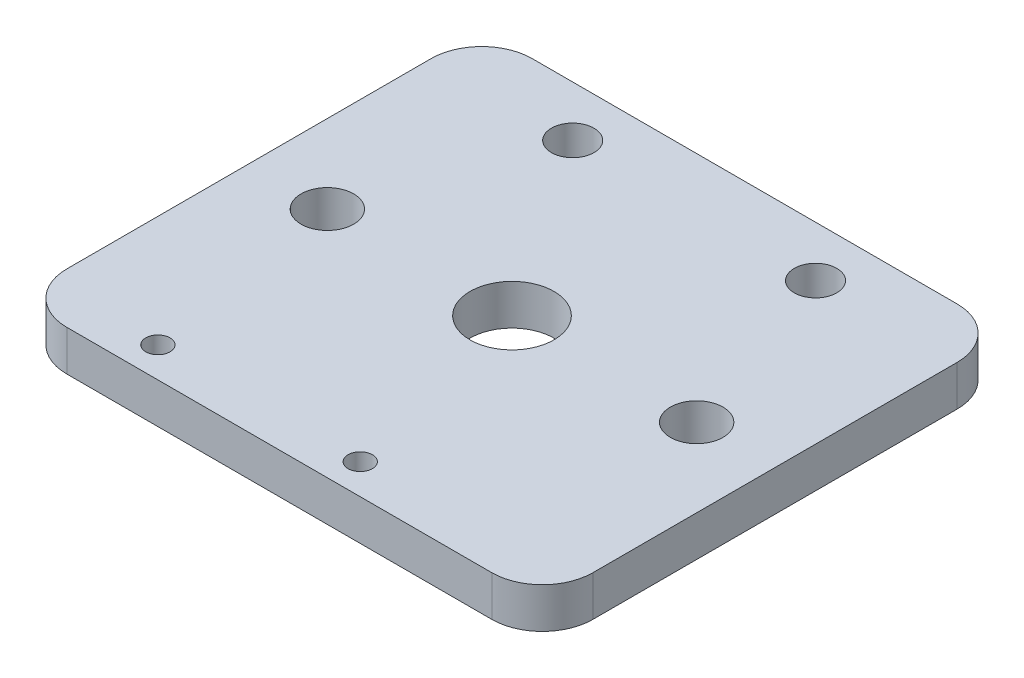
ISO-10303-21;
HEADER;
FILE_DESCRIPTION(('STEP AP214'),'2;1');
FILE_NAME('part.step','',(''),(''),'','','');
FILE_SCHEMA(('AUTOMOTIVE_DESIGN { 1 0 10303 214 1 1 1 1 }'));
ENDSEC;
DATA;
#1=APPLICATION_CONTEXT('core data for automotive mechanical design processes');
#2=APPLICATION_PROTOCOL_DEFINITION('international standard','automotive_design',2000,#1);
#3=PRODUCT_CONTEXT('',#1,'mechanical');
#4=PRODUCT('Part','Part','',(#3));
#5=PRODUCT_RELATED_PRODUCT_CATEGORY('part','',(#4));
#6=PRODUCT_DEFINITION_FORMATION('','',#4);
#7=PRODUCT_DEFINITION_CONTEXT('part definition',#1,'design');
#8=PRODUCT_DEFINITION('design','',#6,#7);
#9=PRODUCT_DEFINITION_SHAPE('','',#8);
#10=(LENGTH_UNIT() NAMED_UNIT(*) SI_UNIT(.MILLI.,.METRE.));
#11=(NAMED_UNIT(*) PLANE_ANGLE_UNIT() SI_UNIT($,.RADIAN.));
#12=(NAMED_UNIT(*) SI_UNIT($,.STERADIAN.) SOLID_ANGLE_UNIT());
#13=UNCERTAINTY_MEASURE_WITH_UNIT(LENGTH_MEASURE(1.E-05),#10,'distance_accuracy_value','');
#14=(GEOMETRIC_REPRESENTATION_CONTEXT(3) GLOBAL_UNCERTAINTY_ASSIGNED_CONTEXT((#13)) GLOBAL_UNIT_ASSIGNED_CONTEXT((#10,
#11,#12)) REPRESENTATION_CONTEXT('',''));
#15=CARTESIAN_POINT('',(0.,0.,0.));
#16=DIRECTION('',(0.,0.,1.));
#17=DIRECTION('',(1.,0.,0.));
#18=AXIS2_PLACEMENT_3D('',#15,#16,#17);
#19=CARTESIAN_POINT('',(0.,4.,0.));
#20=DIRECTION('',(0.,-1.,0.));
#21=DIRECTION('',(0.,0.,-1.));
#22=AXIS2_PLACEMENT_3D('',#19,#20,#21);
#23=PLANE('',#22);
#24=CARTESIAN_POINT('',(4.9999999999951,4.,19.9999999999977));
#25=DIRECTION('',(0.,1.,0.));
#26=DIRECTION('',(0.,0.,1.));
#27=AXIS2_PLACEMENT_3D('',#24,#25,#26);
#28=CIRCLE('',#27,1.19999999999804);
#29=CARTESIAN_POINT('',(4.9999999999951,4.,21.1999999999957));
#30=VERTEX_POINT('',#29);
#31=EDGE_CURVE('E203',#30,#30,#28,.T.);
#32=ORIENTED_EDGE('',*,*,#31,.F.);
#33=EDGE_LOOP('',(#32));
#34=FACE_BOUND('',#33,.T.);
#35=CARTESIAN_POINT('',(-15.0000000000049,4.,19.9999999999977));
#36=DIRECTION('',(0.,1.,0.));
#37=DIRECTION('',(0.,0.,1.));
#38=AXIS2_PLACEMENT_3D('',#35,#36,#37);
#39=CIRCLE('',#38,1.19999999999804);
#40=CARTESIAN_POINT('',(-15.0000000000049,4.,21.1999999999957));
#41=VERTEX_POINT('',#40);
#42=EDGE_CURVE('E195',#41,#41,#39,.T.);
#43=ORIENTED_EDGE('',*,*,#42,.F.);
#44=EDGE_LOOP('',(#43));
#45=FACE_BOUND('',#44,.T.);
#46=CARTESIAN_POINT('',(11.9999999999999,4.,-18.));
#47=DIRECTION('',(0.,1.,0.));
#48=DIRECTION('',(0.,0.,-1.));
#49=AXIS2_PLACEMENT_3D('',#46,#47,#48);
#50=CIRCLE('',#49,2.1);
#51=CARTESIAN_POINT('',(11.9999999999999,4.,-20.1));
#52=VERTEX_POINT('',#51);
#53=EDGE_CURVE('E202',#52,#52,#50,.T.);
#54=ORIENTED_EDGE('',*,*,#53,.F.);
#55=EDGE_LOOP('',(#54));
#56=FACE_BOUND('',#55,.T.);
#57=CARTESIAN_POINT('',(-12.,4.,-18.));
#58=DIRECTION('',(0.,1.,0.));
#59=DIRECTION('',(0.,0.,1.));
#60=AXIS2_PLACEMENT_3D('',#57,#58,#59);
#61=CIRCLE('',#60,2.1);
#62=CARTESIAN_POINT('',(-12.,4.,-15.9));
#63=VERTEX_POINT('',#62);
#64=EDGE_CURVE('E218',#63,#63,#61,.T.);
#65=ORIENTED_EDGE('',*,*,#64,.F.);
#66=EDGE_LOOP('',(#65));
#67=FACE_BOUND('',#66,.T.);
#68=DIRECTION('',(-1.,0.,0.));
#69=VECTOR('',#68,1.);
#70=CARTESIAN_POINT('',(-26.,4.,-23.));
#71=LINE('',#70,#69);
#72=CARTESIAN_POINT('',(20.9999999999981,4.,-23.));
#73=VERTEX_POINT('',#72);
#74=CARTESIAN_POINT('',(-21.,4.,-23.));
#75=VERTEX_POINT('',#74);
#76=EDGE_CURVE('E143',#73,#75,#71,.T.);
#77=ORIENTED_EDGE('',*,*,#76,.T.);
#78=CARTESIAN_POINT('',(-21.,4.,-18.));
#79=DIRECTION('',(0.,-1.,0.));
#80=DIRECTION('',(0.,0.,-1.));
#81=AXIS2_PLACEMENT_3D('',#78,#79,#80);
#82=CIRCLE('',#81,5.);
#83=CARTESIAN_POINT('',(-26.,4.,-18.));
#84=VERTEX_POINT('',#83);
#85=EDGE_CURVE('E170',#75,#84,#82,.F.);
#86=ORIENTED_EDGE('',*,*,#85,.T.);
#87=DIRECTION('',(0.,0.,1.));
#88=VECTOR('',#87,1.);
#89=CARTESIAN_POINT('',(-26.,4.,23.));
#90=LINE('',#89,#88);
#91=CARTESIAN_POINT('',(-26.,4.,18.));
#92=VERTEX_POINT('',#91);
#93=EDGE_CURVE('E128',#84,#92,#90,.T.);
#94=ORIENTED_EDGE('',*,*,#93,.T.);
#95=CARTESIAN_POINT('',(-21.,4.,18.));
#96=DIRECTION('',(0.,-1.,0.));
#97=DIRECTION('',(0.,0.,-1.));
#98=AXIS2_PLACEMENT_3D('',#95,#96,#97);
#99=CIRCLE('',#98,5.);
#100=CARTESIAN_POINT('',(-21.,4.,23.));
#101=VERTEX_POINT('',#100);
#102=EDGE_CURVE('E167',#92,#101,#99,.F.);
#103=ORIENTED_EDGE('',*,*,#102,.T.);
#104=DIRECTION('',(1.,0.,0.));
#105=VECTOR('',#104,1.);
#106=CARTESIAN_POINT('',(-26.,4.,23.));
#107=LINE('',#106,#105);
#108=CARTESIAN_POINT('',(20.9999999999849,4.,23.));
#109=VERTEX_POINT('',#108);
#110=EDGE_CURVE('E150',#101,#109,#107,.T.);
#111=ORIENTED_EDGE('',*,*,#110,.T.);
#112=CARTESIAN_POINT('',(20.999999999985,4.,18.));
#113=DIRECTION('',(0.,-1.,0.));
#114=DIRECTION('',(0.,0.,-1.));
#115=AXIS2_PLACEMENT_3D('',#112,#113,#114);
#116=CIRCLE('',#115,5.);
#117=CARTESIAN_POINT('',(25.999999999985,4.,18.0000000000018));
#118=VERTEX_POINT('',#117);
#119=EDGE_CURVE('E56',#109,#118,#116,.F.);
#120=ORIENTED_EDGE('',*,*,#119,.T.);
#121=DIRECTION('',(-3.66479189990057E-13,0.,1.));
#122=VECTOR('',#121,1.);
#123=CARTESIAN_POINT('',(26.,4.,-23.));
#124=LINE('',#123,#122);
#125=CARTESIAN_POINT('',(25.9999999999981,4.,-17.9999999999982));
#126=VERTEX_POINT('',#125);
#127=EDGE_CURVE('E184',#126,#118,#124,.T.);
#128=ORIENTED_EDGE('',*,*,#127,.F.);
#129=CARTESIAN_POINT('',(20.9999999999981,4.,-18.));
#130=DIRECTION('',(0.,-1.,0.));
#131=DIRECTION('',(0.,0.,-1.));
#132=AXIS2_PLACEMENT_3D('',#129,#130,#131);
#133=CIRCLE('',#132,5.);
#134=EDGE_CURVE('E64',#126,#73,#133,.F.);
#135=ORIENTED_EDGE('',*,*,#134,.T.);
#136=EDGE_LOOP('',(#77,#86,#94,#103,#111,#120,#128,#135));
#137=FACE_BOUND('',#136,.T.);
#138=CARTESIAN_POINT('',(-18.25,4.,0.));
#139=DIRECTION('',(0.,1.,0.));
#140=DIRECTION('',(0.,0.,1.));
#141=AXIS2_PLACEMENT_3D('',#138,#139,#140);
#142=CIRCLE('',#141,2.6);
#143=CARTESIAN_POINT('',(-18.25,4.,2.6));
#144=VERTEX_POINT('',#143);
#145=EDGE_CURVE('E145',#144,#144,#142,.T.);
#146=ORIENTED_EDGE('',*,*,#145,.F.);
#147=EDGE_LOOP('',(#146));
#148=FACE_BOUND('',#147,.T.);
#149=CARTESIAN_POINT('',(18.25,4.,0.));
#150=DIRECTION('',(0.,1.,0.));
#151=DIRECTION('',(0.,0.,-1.));
#152=AXIS2_PLACEMENT_3D('',#149,#150,#151);
#153=CIRCLE('',#152,2.6);
#154=CARTESIAN_POINT('',(18.25,4.,-2.6));
#155=VERTEX_POINT('',#154);
#156=EDGE_CURVE('E238',#155,#155,#153,.T.);
#157=ORIENTED_EDGE('',*,*,#156,.F.);
#158=EDGE_LOOP('',(#157));
#159=FACE_BOUND('',#158,.T.);
#160=CARTESIAN_POINT('',(0.,4.,0.));
#161=DIRECTION('',(0.,1.,0.));
#162=DIRECTION('',(0.,0.,1.));
#163=AXIS2_PLACEMENT_3D('',#160,#161,#162);
#164=CIRCLE('',#163,4.15);
#165=CARTESIAN_POINT('',(0.,4.,4.15));
#166=VERTEX_POINT('',#165);
#167=EDGE_CURVE('E230',#166,#166,#164,.T.);
#168=ORIENTED_EDGE('',*,*,#167,.F.);
#169=EDGE_LOOP('',(#168));
#170=FACE_BOUND('',#169,.T.);
#171=ADVANCED_FACE('F40',(#34,#45,#56,#67,#137,#148,#159,#170),#23,.F.);
#172=CARTESIAN_POINT('',(0.,0.,0.));
#173=DIRECTION('',(0.,-1.,0.));
#174=DIRECTION('',(0.,0.,-1.));
#175=AXIS2_PLACEMENT_3D('',#172,#173,#174);
#176=PLANE('',#175);
#177=DIRECTION('',(0.,0.,1.));
#178=VECTOR('',#177,1.);
#179=CARTESIAN_POINT('',(-26.,0.,23.));
#180=LINE('',#179,#178);
#181=CARTESIAN_POINT('',(-26.,0.,-18.));
#182=VERTEX_POINT('',#181);
#183=CARTESIAN_POINT('',(-26.,0.,18.));
#184=VERTEX_POINT('',#183);
#185=EDGE_CURVE('E125',#182,#184,#180,.T.);
#186=ORIENTED_EDGE('',*,*,#185,.F.);
#187=CARTESIAN_POINT('',(-21.,0.,-18.));
#188=DIRECTION('',(0.,-1.,0.));
#189=DIRECTION('',(0.,0.,-1.));
#190=AXIS2_PLACEMENT_3D('',#187,#188,#189);
#191=CIRCLE('',#190,5.);
#192=CARTESIAN_POINT('',(-21.,0.,-23.));
#193=VERTEX_POINT('',#192);
#194=EDGE_CURVE('E107',#182,#193,#191,.T.);
#195=ORIENTED_EDGE('',*,*,#194,.T.);
#196=DIRECTION('',(-1.,0.,0.));
#197=VECTOR('',#196,1.);
#198=CARTESIAN_POINT('',(-26.,0.,-23.));
#199=LINE('',#198,#197);
#200=CARTESIAN_POINT('',(20.9999999999981,0.,-23.));
#201=VERTEX_POINT('',#200);
#202=EDGE_CURVE('E138',#201,#193,#199,.T.);
#203=ORIENTED_EDGE('',*,*,#202,.F.);
#204=CARTESIAN_POINT('',(20.9999999999981,0.,-18.));
#205=DIRECTION('',(0.,-1.,0.));
#206=DIRECTION('',(0.,0.,-1.));
#207=AXIS2_PLACEMENT_3D('',#204,#205,#206);
#208=CIRCLE('',#207,5.);
#209=CARTESIAN_POINT('',(25.9999999999981,0.,-17.9999999999982));
#210=VERTEX_POINT('',#209);
#211=EDGE_CURVE('E130',#201,#210,#208,.T.);
#212=ORIENTED_EDGE('',*,*,#211,.T.);
#213=DIRECTION('',(-3.66479189990057E-13,0.,1.));
#214=VECTOR('',#213,1.);
#215=CARTESIAN_POINT('',(26.,0.,-23.));
#216=LINE('',#215,#214);
#217=CARTESIAN_POINT('',(25.999999999985,0.,18.0000000000018));
#218=VERTEX_POINT('',#217);
#219=EDGE_CURVE('E187',#210,#218,#216,.T.);
#220=ORIENTED_EDGE('',*,*,#219,.T.);
#221=CARTESIAN_POINT('',(20.999999999985,0.,18.));
#222=DIRECTION('',(0.,-1.,0.));
#223=DIRECTION('',(0.,0.,-1.));
#224=AXIS2_PLACEMENT_3D('',#221,#222,#223);
#225=CIRCLE('',#224,5.);
#226=CARTESIAN_POINT('',(20.9999999999849,0.,23.));
#227=VERTEX_POINT('',#226);
#228=EDGE_CURVE('E154',#218,#227,#225,.T.);
#229=ORIENTED_EDGE('',*,*,#228,.T.);
#230=DIRECTION('',(1.,0.,0.));
#231=VECTOR('',#230,1.);
#232=CARTESIAN_POINT('',(-26.,0.,23.));
#233=LINE('',#232,#231);
#234=CARTESIAN_POINT('',(-21.,0.,23.));
#235=VERTEX_POINT('',#234);
#236=EDGE_CURVE('E137',#235,#227,#233,.T.);
#237=ORIENTED_EDGE('',*,*,#236,.F.);
#238=CARTESIAN_POINT('',(-21.,0.,18.));
#239=DIRECTION('',(0.,-1.,0.));
#240=DIRECTION('',(0.,0.,-1.));
#241=AXIS2_PLACEMENT_3D('',#238,#239,#240);
#242=CIRCLE('',#241,5.);
#243=EDGE_CURVE('E119',#235,#184,#242,.T.);
#244=ORIENTED_EDGE('',*,*,#243,.T.);
#245=EDGE_LOOP('',(#186,#195,#203,#212,#220,#229,#237,#244));
#246=FACE_BOUND('',#245,.T.);
#247=CARTESIAN_POINT('',(4.9999999999951,0.,19.9999999999977));
#248=DIRECTION('',(0.,1.,0.));
#249=DIRECTION('',(0.,0.,1.));
#250=AXIS2_PLACEMENT_3D('',#247,#248,#249);
#251=CIRCLE('',#250,1.19999999999804);
#252=CARTESIAN_POINT('',(4.9999999999951,0.,21.1999999999957));
#253=VERTEX_POINT('',#252);
#254=EDGE_CURVE('E198',#253,#253,#251,.T.);
#255=ORIENTED_EDGE('',*,*,#254,.T.);
#256=EDGE_LOOP('',(#255));
#257=FACE_BOUND('',#256,.T.);
#258=CARTESIAN_POINT('',(-15.0000000000049,0.,19.9999999999977));
#259=DIRECTION('',(0.,1.,0.));
#260=DIRECTION('',(0.,0.,1.));
#261=AXIS2_PLACEMENT_3D('',#258,#259,#260);
#262=CIRCLE('',#261,1.19999999999804);
#263=CARTESIAN_POINT('',(-15.0000000000049,0.,21.1999999999957));
#264=VERTEX_POINT('',#263);
#265=EDGE_CURVE('E207',#264,#264,#262,.T.);
#266=ORIENTED_EDGE('',*,*,#265,.T.);
#267=EDGE_LOOP('',(#266));
#268=FACE_BOUND('',#267,.T.);
#269=CARTESIAN_POINT('',(11.9999999999999,0.,-18.));
#270=DIRECTION('',(0.,1.,0.));
#271=DIRECTION('',(0.,0.,-1.));
#272=AXIS2_PLACEMENT_3D('',#269,#270,#271);
#273=CIRCLE('',#272,2.1);
#274=CARTESIAN_POINT('',(11.9999999999999,0.,-20.1));
#275=VERTEX_POINT('',#274);
#276=EDGE_CURVE('E214',#275,#275,#273,.T.);
#277=ORIENTED_EDGE('',*,*,#276,.T.);
#278=EDGE_LOOP('',(#277));
#279=FACE_BOUND('',#278,.T.);
#280=CARTESIAN_POINT('',(-12.,0.,-18.));
#281=DIRECTION('',(0.,1.,0.));
#282=DIRECTION('',(0.,0.,1.));
#283=AXIS2_PLACEMENT_3D('',#280,#281,#282);
#284=CIRCLE('',#283,2.1);
#285=CARTESIAN_POINT('',(-12.,0.,-15.9));
#286=VERTEX_POINT('',#285);
#287=EDGE_CURVE('E222',#286,#286,#284,.T.);
#288=ORIENTED_EDGE('',*,*,#287,.T.);
#289=EDGE_LOOP('',(#288));
#290=FACE_BOUND('',#289,.T.);
#291=CARTESIAN_POINT('',(18.25,0.,0.));
#292=DIRECTION('',(0.,1.,0.));
#293=DIRECTION('',(0.,0.,-1.));
#294=AXIS2_PLACEMENT_3D('',#291,#292,#293);
#295=CIRCLE('',#294,2.6);
#296=CARTESIAN_POINT('',(18.25,0.,-2.6));
#297=VERTEX_POINT('',#296);
#298=EDGE_CURVE('E234',#297,#297,#295,.T.);
#299=ORIENTED_EDGE('',*,*,#298,.T.);
#300=EDGE_LOOP('',(#299));
#301=FACE_BOUND('',#300,.T.);
#302=CARTESIAN_POINT('',(-18.25,0.,0.));
#303=DIRECTION('',(0.,1.,0.));
#304=DIRECTION('',(0.,0.,1.));
#305=AXIS2_PLACEMENT_3D('',#302,#303,#304);
#306=CIRCLE('',#305,2.6);
#307=CARTESIAN_POINT('',(-18.25,0.,2.6));
#308=VERTEX_POINT('',#307);
#309=EDGE_CURVE('E242',#308,#308,#306,.T.);
#310=ORIENTED_EDGE('',*,*,#309,.T.);
#311=EDGE_LOOP('',(#310));
#312=FACE_BOUND('',#311,.T.);
#313=CARTESIAN_POINT('',(0.,0.,0.));
#314=DIRECTION('',(0.,1.,0.));
#315=DIRECTION('',(0.,0.,1.));
#316=AXIS2_PLACEMENT_3D('',#313,#314,#315);
#317=CIRCLE('',#316,4.15);
#318=CARTESIAN_POINT('',(0.,0.,4.15));
#319=VERTEX_POINT('',#318);
#320=EDGE_CURVE('E226',#319,#319,#317,.T.);
#321=ORIENTED_EDGE('',*,*,#320,.T.);
#322=EDGE_LOOP('',(#321));
#323=FACE_BOUND('',#322,.T.);
#324=ADVANCED_FACE('F133',(#246,#257,#268,#279,#290,#301,#312,#323),#176,.T.);
#325=CARTESIAN_POINT('',(-26.,4.,-23.));
#326=DIRECTION('',(0.,0.,1.));
#327=DIRECTION('',(1.,0.,0.));
#328=AXIS2_PLACEMENT_3D('',#325,#326,#327);
#329=PLANE('',#328);
#330=ORIENTED_EDGE('',*,*,#202,.T.);
#331=DIRECTION('',(0.,-1.,0.));
#332=VECTOR('',#331,1.);
#333=CARTESIAN_POINT('',(-21.,4.,-23.));
#334=LINE('',#333,#332);
#335=EDGE_CURVE('E112',#193,#75,#334,.F.);
#336=ORIENTED_EDGE('',*,*,#335,.T.);
#337=ORIENTED_EDGE('',*,*,#76,.F.);
#338=DIRECTION('',(0.,1.,0.));
#339=VECTOR('',#338,1.);
#340=CARTESIAN_POINT('',(20.9999999999981,4.,-23.));
#341=LINE('',#340,#339);
#342=EDGE_CURVE('E118',#73,#201,#341,.F.);
#343=ORIENTED_EDGE('',*,*,#342,.T.);
#344=EDGE_LOOP('',(#330,#336,#337,#343));
#345=FACE_BOUND('',#344,.T.);
#346=ADVANCED_FACE('F265',(#345),#329,.F.);
#347=CARTESIAN_POINT('',(-26.,4.,23.));
#348=DIRECTION('',(1.,0.,0.));
#349=DIRECTION('',(0.,0.,-1.));
#350=AXIS2_PLACEMENT_3D('',#347,#348,#349);
#351=PLANE('',#350);
#352=ORIENTED_EDGE('',*,*,#93,.F.);
#353=DIRECTION('',(0.,-1.,0.));
#354=VECTOR('',#353,1.);
#355=CARTESIAN_POINT('',(-26.,4.,-18.));
#356=LINE('',#355,#354);
#357=EDGE_CURVE('E111',#84,#182,#356,.T.);
#358=ORIENTED_EDGE('',*,*,#357,.T.);
#359=ORIENTED_EDGE('',*,*,#185,.T.);
#360=DIRECTION('',(0.,-1.,0.));
#361=VECTOR('',#360,1.);
#362=CARTESIAN_POINT('',(-26.,4.,18.));
#363=LINE('',#362,#361);
#364=EDGE_CURVE('E131',#184,#92,#363,.F.);
#365=ORIENTED_EDGE('',*,*,#364,.T.);
#366=EDGE_LOOP('',(#352,#358,#359,#365));
#367=FACE_BOUND('',#366,.T.);
#368=ADVANCED_FACE('F124',(#367),#351,.F.);
#369=CARTESIAN_POINT('',(-26.,4.,23.));
#370=DIRECTION('',(0.,0.,-1.));
#371=DIRECTION('',(-1.,0.,0.));
#372=AXIS2_PLACEMENT_3D('',#369,#370,#371);
#373=PLANE('',#372);
#374=ORIENTED_EDGE('',*,*,#110,.F.);
#375=DIRECTION('',(0.,-1.,0.));
#376=VECTOR('',#375,1.);
#377=CARTESIAN_POINT('',(-21.,4.,23.));
#378=LINE('',#377,#376);
#379=EDGE_CURVE('E177',#101,#235,#378,.T.);
#380=ORIENTED_EDGE('',*,*,#379,.T.);
#381=ORIENTED_EDGE('',*,*,#236,.T.);
#382=DIRECTION('',(0.,1.,0.));
#383=VECTOR('',#382,1.);
#384=CARTESIAN_POINT('',(20.999999999985,4.,23.));
#385=LINE('',#384,#383);
#386=EDGE_CURVE('E173',#227,#109,#385,.T.);
#387=ORIENTED_EDGE('',*,*,#386,.T.);
#388=EDGE_LOOP('',(#374,#380,#381,#387));
#389=FACE_BOUND('',#388,.T.);
#390=ADVANCED_FACE('F260',(#389),#373,.F.);
#391=CARTESIAN_POINT('',(-18.25,4.,0.));
#392=DIRECTION('',(0.,-1.,0.));
#393=DIRECTION('',(0.,0.,-1.));
#394=AXIS2_PLACEMENT_3D('',#391,#392,#393);
#395=CYLINDRICAL_SURFACE('',#394,2.6);
#396=ORIENTED_EDGE('',*,*,#145,.T.);
#397=EDGE_LOOP('',(#396));
#398=FACE_BOUND('',#397,.T.);
#399=ORIENTED_EDGE('',*,*,#309,.F.);
#400=EDGE_LOOP('',(#399));
#401=FACE_BOUND('',#400,.T.);
#402=ADVANCED_FACE('F286',(#398,#401),#395,.F.);
#403=CARTESIAN_POINT('',(18.25,4.,0.));
#404=DIRECTION('',(0.,-1.,0.));
#405=DIRECTION('',(0.,0.,-1.));
#406=AXIS2_PLACEMENT_3D('',#403,#404,#405);
#407=CYLINDRICAL_SURFACE('',#406,2.6);
#408=ORIENTED_EDGE('',*,*,#156,.T.);
#409=EDGE_LOOP('',(#408));
#410=FACE_BOUND('',#409,.T.);
#411=ORIENTED_EDGE('',*,*,#298,.F.);
#412=EDGE_LOOP('',(#411));
#413=FACE_BOUND('',#412,.T.);
#414=ADVANCED_FACE('F321',(#410,#413),#407,.F.);
#415=CARTESIAN_POINT('',(0.,4.,0.));
#416=DIRECTION('',(0.,-1.,0.));
#417=DIRECTION('',(0.,0.,-1.));
#418=AXIS2_PLACEMENT_3D('',#415,#416,#417);
#419=CYLINDRICAL_SURFACE('',#418,4.15);
#420=ORIENTED_EDGE('',*,*,#167,.T.);
#421=EDGE_LOOP('',(#420));
#422=FACE_BOUND('',#421,.T.);
#423=ORIENTED_EDGE('',*,*,#320,.F.);
#424=EDGE_LOOP('',(#423));
#425=FACE_BOUND('',#424,.T.);
#426=ADVANCED_FACE('F318',(#422,#425),#419,.F.);
#427=CARTESIAN_POINT('',(-12.,0.,-18.));
#428=DIRECTION('',(0.,1.,0.));
#429=DIRECTION('',(0.,0.,1.));
#430=AXIS2_PLACEMENT_3D('',#427,#428,#429);
#431=CYLINDRICAL_SURFACE('',#430,2.1);
#432=ORIENTED_EDGE('',*,*,#287,.F.);
#433=EDGE_LOOP('',(#432));
#434=FACE_BOUND('',#433,.T.);
#435=ORIENTED_EDGE('',*,*,#64,.T.);
#436=EDGE_LOOP('',(#435));
#437=FACE_BOUND('',#436,.T.);
#438=ADVANCED_FACE('F314',(#434,#437),#431,.F.);
#439=CARTESIAN_POINT('',(11.9999999999999,0.,-18.));
#440=DIRECTION('',(0.,1.,0.));
#441=DIRECTION('',(0.,0.,1.));
#442=AXIS2_PLACEMENT_3D('',#439,#440,#441);
#443=CYLINDRICAL_SURFACE('',#442,2.1);
#444=ORIENTED_EDGE('',*,*,#276,.F.);
#445=EDGE_LOOP('',(#444));
#446=FACE_BOUND('',#445,.T.);
#447=ORIENTED_EDGE('',*,*,#53,.T.);
#448=EDGE_LOOP('',(#447));
#449=FACE_BOUND('',#448,.T.);
#450=ADVANCED_FACE('F310',(#446,#449),#443,.F.);
#451=CARTESIAN_POINT('',(-15.0000000000049,0.,19.9999999999977));
#452=DIRECTION('',(0.,1.,0.));
#453=DIRECTION('',(0.,0.,1.));
#454=AXIS2_PLACEMENT_3D('',#451,#452,#453);
#455=CYLINDRICAL_SURFACE('',#454,1.19999999999804);
#456=ORIENTED_EDGE('',*,*,#265,.F.);
#457=EDGE_LOOP('',(#456));
#458=FACE_BOUND('',#457,.T.);
#459=ORIENTED_EDGE('',*,*,#42,.T.);
#460=EDGE_LOOP('',(#459));
#461=FACE_BOUND('',#460,.T.);
#462=ADVANCED_FACE('F304',(#458,#461),#455,.F.);
#463=CARTESIAN_POINT('',(4.9999999999951,0.,19.9999999999977));
#464=DIRECTION('',(0.,1.,0.));
#465=DIRECTION('',(0.,0.,1.));
#466=AXIS2_PLACEMENT_3D('',#463,#464,#465);
#467=CYLINDRICAL_SURFACE('',#466,1.19999999999804);
#468=ORIENTED_EDGE('',*,*,#254,.F.);
#469=EDGE_LOOP('',(#468));
#470=FACE_BOUND('',#469,.T.);
#471=ORIENTED_EDGE('',*,*,#31,.T.);
#472=EDGE_LOOP('',(#471));
#473=FACE_BOUND('',#472,.T.);
#474=ADVANCED_FACE('F299',(#470,#473),#467,.F.);
#475=CARTESIAN_POINT('',(26.,0.,-23.));
#476=DIRECTION('',(-1.,0.,-3.66479189990057E-13));
#477=DIRECTION('',(-3.66479189990057E-13,0.,1.));
#478=AXIS2_PLACEMENT_3D('',#475,#476,#477);
#479=PLANE('',#478);
#480=ORIENTED_EDGE('',*,*,#127,.T.);
#481=DIRECTION('',(0.,1.,0.));
#482=VECTOR('',#481,1.);
#483=CARTESIAN_POINT('',(25.999999999985,0.,18.0000000000018));
#484=LINE('',#483,#482);
#485=EDGE_CURVE('E11',#118,#218,#484,.F.);
#486=ORIENTED_EDGE('',*,*,#485,.T.);
#487=ORIENTED_EDGE('',*,*,#219,.F.);
#488=DIRECTION('',(0.,1.,0.));
#489=VECTOR('',#488,1.);
#490=CARTESIAN_POINT('',(25.9999999999981,0.,-17.9999999999982));
#491=LINE('',#490,#489);
#492=EDGE_CURVE('E49',#210,#126,#491,.T.);
#493=ORIENTED_EDGE('',*,*,#492,.T.);
#494=EDGE_LOOP('',(#480,#486,#487,#493));
#495=FACE_BOUND('',#494,.T.);
#496=ADVANCED_FACE('F183',(#495),#479,.F.);
#497=CARTESIAN_POINT('',(-21.,4.,-18.));
#498=DIRECTION('',(0.,-1.,0.));
#499=DIRECTION('',(0.,0.,-1.));
#500=AXIS2_PLACEMENT_3D('',#497,#498,#499);
#501=CYLINDRICAL_SURFACE('',#500,5.);
#502=ORIENTED_EDGE('',*,*,#85,.F.);
#503=ORIENTED_EDGE('',*,*,#335,.F.);
#504=ORIENTED_EDGE('',*,*,#194,.F.);
#505=ORIENTED_EDGE('',*,*,#357,.F.);
#506=EDGE_LOOP('',(#502,#503,#504,#505));
#507=FACE_BOUND('',#506,.T.);
#508=ADVANCED_FACE('F110',(#507),#501,.T.);
#509=CARTESIAN_POINT('',(-21.,4.,18.));
#510=DIRECTION('',(0.,-1.,0.));
#511=DIRECTION('',(0.,0.,-1.));
#512=AXIS2_PLACEMENT_3D('',#509,#510,#511);
#513=CYLINDRICAL_SURFACE('',#512,5.);
#514=ORIENTED_EDGE('',*,*,#102,.F.);
#515=ORIENTED_EDGE('',*,*,#364,.F.);
#516=ORIENTED_EDGE('',*,*,#243,.F.);
#517=ORIENTED_EDGE('',*,*,#379,.F.);
#518=EDGE_LOOP('',(#514,#515,#516,#517));
#519=FACE_BOUND('',#518,.T.);
#520=ADVANCED_FACE('F263',(#519),#513,.T.);
#521=CARTESIAN_POINT('',(20.999999999985,4.,18.));
#522=DIRECTION('',(0.,1.,0.));
#523=DIRECTION('',(0.,0.,1.));
#524=AXIS2_PLACEMENT_3D('',#521,#522,#523);
#525=CYLINDRICAL_SURFACE('',#524,5.);
#526=ORIENTED_EDGE('',*,*,#228,.F.);
#527=ORIENTED_EDGE('',*,*,#485,.F.);
#528=ORIENTED_EDGE('',*,*,#119,.F.);
#529=ORIENTED_EDGE('',*,*,#386,.F.);
#530=EDGE_LOOP('',(#526,#527,#528,#529));
#531=FACE_BOUND('',#530,.T.);
#532=ADVANCED_FACE('F268',(#531),#525,.T.);
#533=CARTESIAN_POINT('',(20.9999999999981,0.,-18.));
#534=DIRECTION('',(0.,1.,0.));
#535=DIRECTION('',(0.,0.,1.));
#536=AXIS2_PLACEMENT_3D('',#533,#534,#535);
#537=CYLINDRICAL_SURFACE('',#536,5.);
#538=ORIENTED_EDGE('',*,*,#211,.F.);
#539=ORIENTED_EDGE('',*,*,#342,.F.);
#540=ORIENTED_EDGE('',*,*,#134,.F.);
#541=ORIENTED_EDGE('',*,*,#492,.F.);
#542=EDGE_LOOP('',(#538,#539,#540,#541));
#543=FACE_BOUND('',#542,.T.);
#544=ADVANCED_FACE('F42',(#543),#537,.T.);
#545=CLOSED_SHELL('',(#171,#324,#346,#368,#390,#402,#414,#426,#438,#450,#462,#474,#496,#508,
#520,#532,#544));
#546=MANIFOLD_SOLID_BREP('B2',#545);
#547=ADVANCED_BREP_SHAPE_REPRESENTATION('',(#18,#546),#14);
#548=SHAPE_DEFINITION_REPRESENTATION(#9,#547);
ENDSEC;
END-ISO-10303-21;
